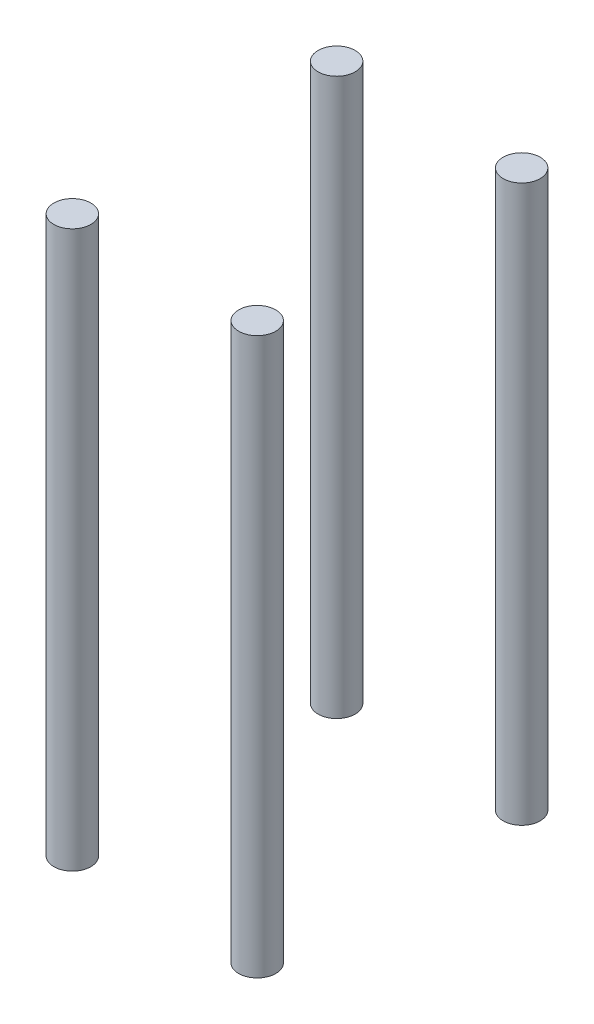
ISO-10303-21;
HEADER;
FILE_DESCRIPTION(('STEP AP214'),'2;1');
FILE_NAME('part.step','',(''),(''),'','','');
FILE_SCHEMA(('AUTOMOTIVE_DESIGN { 1 0 10303 214 1 1 1 1 }'));
ENDSEC;
DATA;
#1=APPLICATION_CONTEXT('core data for automotive mechanical design processes');
#2=APPLICATION_PROTOCOL_DEFINITION('international standard','automotive_design',2000,#1);
#3=PRODUCT_CONTEXT('',#1,'mechanical');
#4=PRODUCT('Part','Part','',(#3));
#5=PRODUCT_RELATED_PRODUCT_CATEGORY('part','',(#4));
#6=PRODUCT_DEFINITION_FORMATION('','',#4);
#7=PRODUCT_DEFINITION_CONTEXT('part definition',#1,'design');
#8=PRODUCT_DEFINITION('design','',#6,#7);
#9=PRODUCT_DEFINITION_SHAPE('','',#8);
#10=(LENGTH_UNIT() NAMED_UNIT(*) SI_UNIT(.MILLI.,.METRE.));
#11=(NAMED_UNIT(*) PLANE_ANGLE_UNIT() SI_UNIT($,.RADIAN.));
#12=(NAMED_UNIT(*) SI_UNIT($,.STERADIAN.) SOLID_ANGLE_UNIT());
#13=UNCERTAINTY_MEASURE_WITH_UNIT(LENGTH_MEASURE(1.E-05),#10,'distance_accuracy_value','');
#14=(GEOMETRIC_REPRESENTATION_CONTEXT(3) GLOBAL_UNCERTAINTY_ASSIGNED_CONTEXT((#13)) GLOBAL_UNIT_ASSIGNED_CONTEXT((#10,
#11,#12)) REPRESENTATION_CONTEXT('',''));
#15=CARTESIAN_POINT('',(0.,0.,0.));
#16=DIRECTION('',(0.,0.,1.));
#17=DIRECTION('',(1.,0.,0.));
#18=AXIS2_PLACEMENT_3D('',#15,#16,#17);
#19=CARTESIAN_POINT('',(-20.5752601866195,120.,28.5053162656339));
#20=DIRECTION('',(0.,-1.,0.));
#21=DIRECTION('',(0.,0.,-1.));
#22=AXIS2_PLACEMENT_3D('',#19,#20,#21);
#23=CYLINDRICAL_SURFACE('',#22,4.);
#24=CARTESIAN_POINT('',(-20.5752601866195,120.,28.5053162656339));
#25=DIRECTION('',(0.,1.,0.));
#26=DIRECTION('',(0.,0.,1.));
#27=AXIS2_PLACEMENT_3D('',#24,#25,#26);
#28=CIRCLE('',#27,4.);
#29=CARTESIAN_POINT('',(-20.5752601866195,120.,32.5053162656339));
#30=VERTEX_POINT('',#29);
#31=EDGE_CURVE('E13',#30,#30,#28,.T.);
#32=ORIENTED_EDGE('',*,*,#31,.F.);
#33=EDGE_LOOP('',(#32));
#34=FACE_BOUND('',#33,.T.);
#35=CARTESIAN_POINT('',(-20.5752601866195,0.,28.5053162656339));
#36=DIRECTION('',(0.,1.,0.));
#37=DIRECTION('',(0.,0.,1.));
#38=AXIS2_PLACEMENT_3D('',#35,#36,#37);
#39=CIRCLE('',#38,4.);
#40=CARTESIAN_POINT('',(-20.5752601866195,0.,32.5053162656339));
#41=VERTEX_POINT('',#40);
#42=EDGE_CURVE('E60',#41,#41,#39,.T.);
#43=ORIENTED_EDGE('',*,*,#42,.T.);
#44=EDGE_LOOP('',(#43));
#45=FACE_BOUND('',#44,.T.);
#46=ADVANCED_FACE('F57',(#34,#45),#23,.T.);
#47=CARTESIAN_POINT('',(-20.5752601866195,120.,28.5053162656339));
#48=DIRECTION('',(0.,1.,0.));
#49=DIRECTION('',(0.,0.,1.));
#50=AXIS2_PLACEMENT_3D('',#47,#48,#49);
#51=PLANE('',#50);
#52=ORIENTED_EDGE('',*,*,#31,.T.);
#53=EDGE_LOOP('',(#52));
#54=FACE_BOUND('',#53,.T.);
#55=ADVANCED_FACE('F72',(#54),#51,.T.);
#56=CARTESIAN_POINT('',(-20.5752601866195,0.,28.5053162656339));
#57=DIRECTION('',(0.,1.,0.));
#58=DIRECTION('',(0.,0.,1.));
#59=AXIS2_PLACEMENT_3D('',#56,#57,#58);
#60=PLANE('',#59);
#61=ORIENTED_EDGE('',*,*,#42,.F.);
#62=EDGE_LOOP('',(#61));
#63=FACE_BOUND('',#62,.T.);
#64=ADVANCED_FACE('F70',(#63),#60,.F.);
#65=CLOSED_SHELL('',(#46,#55,#64));
#66=MANIFOLD_SOLID_BREP('B2',#65);
#67=CARTESIAN_POINT('',(19.3252601866195,120.,28.5188644447428));
#68=DIRECTION('',(0.,-1.,0.));
#69=DIRECTION('',(0.,0.,-1.));
#70=AXIS2_PLACEMENT_3D('',#67,#68,#69);
#71=CYLINDRICAL_SURFACE('',#70,3.99999999999999);
#72=CARTESIAN_POINT('',(19.3252601866195,120.,28.5188644447428));
#73=DIRECTION('',(0.,1.,0.));
#74=DIRECTION('',(0.,0.,-1.));
#75=AXIS2_PLACEMENT_3D('',#72,#73,#74);
#76=CIRCLE('',#75,3.99999999999999);
#77=CARTESIAN_POINT('',(19.3252601866195,120.,24.5188644447428));
#78=VERTEX_POINT('',#77);
#79=EDGE_CURVE('E56',#78,#78,#76,.T.);
#80=ORIENTED_EDGE('',*,*,#79,.F.);
#81=EDGE_LOOP('',(#80));
#82=FACE_BOUND('',#81,.T.);
#83=CARTESIAN_POINT('',(19.3252601866195,0.,28.5188644447428));
#84=DIRECTION('',(0.,1.,0.));
#85=DIRECTION('',(0.,0.,-1.));
#86=AXIS2_PLACEMENT_3D('',#83,#84,#85);
#87=CIRCLE('',#86,3.99999999999999);
#88=CARTESIAN_POINT('',(19.3252601866195,0.,24.5188644447428));
#89=VERTEX_POINT('',#88);
#90=EDGE_CURVE('E116',#89,#89,#87,.T.);
#91=ORIENTED_EDGE('',*,*,#90,.T.);
#92=EDGE_LOOP('',(#91));
#93=FACE_BOUND('',#92,.T.);
#94=ADVANCED_FACE('F113',(#82,#93),#71,.T.);
#95=CARTESIAN_POINT('',(19.3252601866195,120.,28.5188644447428));
#96=DIRECTION('',(0.,-1.,0.));
#97=DIRECTION('',(0.,0.,-1.));
#98=AXIS2_PLACEMENT_3D('',#95,#96,#97);
#99=PLANE('',#98);
#100=ORIENTED_EDGE('',*,*,#79,.T.);
#101=EDGE_LOOP('',(#100));
#102=FACE_BOUND('',#101,.T.);
#103=ADVANCED_FACE('F128',(#102),#99,.F.);
#104=CARTESIAN_POINT('',(19.3252601866195,0.,28.5188644447428));
#105=DIRECTION('',(0.,-1.,0.));
#106=DIRECTION('',(0.,0.,-1.));
#107=AXIS2_PLACEMENT_3D('',#104,#105,#106);
#108=PLANE('',#107);
#109=ORIENTED_EDGE('',*,*,#90,.F.);
#110=EDGE_LOOP('',(#109));
#111=FACE_BOUND('',#110,.T.);
#112=ADVANCED_FACE('F126',(#111),#108,.T.);
#113=CLOSED_SHELL('',(#94,#103,#112));
#114=MANIFOLD_SOLID_BREP('B8',#113);
#115=CARTESIAN_POINT('',(-20.5752601866195,120.,-28.5053162656339));
#116=DIRECTION('',(0.,-1.,0.));
#117=DIRECTION('',(0.,0.,-1.));
#118=AXIS2_PLACEMENT_3D('',#115,#116,#117);
#119=CYLINDRICAL_SURFACE('',#118,4.);
#120=CARTESIAN_POINT('',(-20.5752601866195,120.,-28.5053162656339));
#121=DIRECTION('',(0.,1.,0.));
#122=DIRECTION('',(0.,0.,-1.));
#123=AXIS2_PLACEMENT_3D('',#120,#121,#122);
#124=CIRCLE('',#123,4.);
#125=CARTESIAN_POINT('',(-20.5752601866195,120.,-32.5053162656339));
#126=VERTEX_POINT('',#125);
#127=EDGE_CURVE('E112',#126,#126,#124,.T.);
#128=ORIENTED_EDGE('',*,*,#127,.F.);
#129=EDGE_LOOP('',(#128));
#130=FACE_BOUND('',#129,.T.);
#131=CARTESIAN_POINT('',(-20.5752601866195,0.,-28.5053162656339));
#132=DIRECTION('',(0.,1.,0.));
#133=DIRECTION('',(0.,0.,-1.));
#134=AXIS2_PLACEMENT_3D('',#131,#132,#133);
#135=CIRCLE('',#134,4.);
#136=CARTESIAN_POINT('',(-20.5752601866195,0.,-32.5053162656339));
#137=VERTEX_POINT('',#136);
#138=EDGE_CURVE('E172',#137,#137,#135,.T.);
#139=ORIENTED_EDGE('',*,*,#138,.T.);
#140=EDGE_LOOP('',(#139));
#141=FACE_BOUND('',#140,.T.);
#142=ADVANCED_FACE('F169',(#130,#141),#119,.T.);
#143=CARTESIAN_POINT('',(-20.5752601866195,120.,-28.5053162656339));
#144=DIRECTION('',(0.,-1.,0.));
#145=DIRECTION('',(0.,0.,-1.));
#146=AXIS2_PLACEMENT_3D('',#143,#144,#145);
#147=PLANE('',#146);
#148=ORIENTED_EDGE('',*,*,#127,.T.);
#149=EDGE_LOOP('',(#148));
#150=FACE_BOUND('',#149,.T.);
#151=ADVANCED_FACE('F186',(#150),#147,.F.);
#152=CARTESIAN_POINT('',(-20.5752601866195,0.,-28.5053162656339));
#153=DIRECTION('',(0.,-1.,0.));
#154=DIRECTION('',(0.,0.,-1.));
#155=AXIS2_PLACEMENT_3D('',#152,#153,#154);
#156=PLANE('',#155);
#157=ORIENTED_EDGE('',*,*,#138,.F.);
#158=EDGE_LOOP('',(#157));
#159=FACE_BOUND('',#158,.T.);
#160=ADVANCED_FACE('F184',(#159),#156,.T.);
#161=CLOSED_SHELL('',(#142,#151,#160));
#162=MANIFOLD_SOLID_BREP('B51',#161);
#163=CARTESIAN_POINT('',(19.3252601866195,120.,-28.5188644447428));
#164=DIRECTION('',(0.,-1.,0.));
#165=DIRECTION('',(0.,0.,-1.));
#166=AXIS2_PLACEMENT_3D('',#163,#164,#165);
#167=CYLINDRICAL_SURFACE('',#166,3.99999999999999);
#168=CARTESIAN_POINT('',(19.3252601866195,120.,-28.5188644447428));
#169=DIRECTION('',(0.,1.,0.));
#170=DIRECTION('',(0.,0.,1.));
#171=AXIS2_PLACEMENT_3D('',#168,#169,#170);
#172=CIRCLE('',#171,3.99999999999999);
#173=CARTESIAN_POINT('',(19.3252601866195,120.,-24.5188644447428));
#174=VERTEX_POINT('',#173);
#175=EDGE_CURVE('E168',#174,#174,#172,.T.);
#176=ORIENTED_EDGE('',*,*,#175,.F.);
#177=EDGE_LOOP('',(#176));
#178=FACE_BOUND('',#177,.T.);
#179=CARTESIAN_POINT('',(19.3252601866195,0.,-28.5188644447428));
#180=DIRECTION('',(0.,1.,0.));
#181=DIRECTION('',(0.,0.,1.));
#182=AXIS2_PLACEMENT_3D('',#179,#180,#181);
#183=CIRCLE('',#182,3.99999999999999);
#184=CARTESIAN_POINT('',(19.3252601866195,0.,-24.5188644447428));
#185=VERTEX_POINT('',#184);
#186=EDGE_CURVE('E220',#185,#185,#183,.T.);
#187=ORIENTED_EDGE('',*,*,#186,.T.);
#188=EDGE_LOOP('',(#187));
#189=FACE_BOUND('',#188,.T.);
#190=ADVANCED_FACE('F217',(#178,#189),#167,.T.);
#191=CARTESIAN_POINT('',(19.3252601866195,120.,-28.5188644447428));
#192=DIRECTION('',(0.,1.,0.));
#193=DIRECTION('',(0.,0.,1.));
#194=AXIS2_PLACEMENT_3D('',#191,#192,#193);
#195=PLANE('',#194);
#196=ORIENTED_EDGE('',*,*,#175,.T.);
#197=EDGE_LOOP('',(#196));
#198=FACE_BOUND('',#197,.T.);
#199=ADVANCED_FACE('F232',(#198),#195,.T.);
#200=CARTESIAN_POINT('',(19.3252601866195,0.,-28.5188644447428));
#201=DIRECTION('',(0.,1.,0.));
#202=DIRECTION('',(0.,0.,1.));
#203=AXIS2_PLACEMENT_3D('',#200,#201,#202);
#204=PLANE('',#203);
#205=ORIENTED_EDGE('',*,*,#186,.F.);
#206=EDGE_LOOP('',(#205));
#207=FACE_BOUND('',#206,.T.);
#208=ADVANCED_FACE('F230',(#207),#204,.F.);
#209=CLOSED_SHELL('',(#190,#199,#208));
#210=MANIFOLD_SOLID_BREP('B107',#209);
#211=ADVANCED_BREP_SHAPE_REPRESENTATION('',(#18,#66,#114,#162,#210),#14);
#212=SHAPE_DEFINITION_REPRESENTATION(#9,#211);
ENDSEC;
END-ISO-10303-21;
